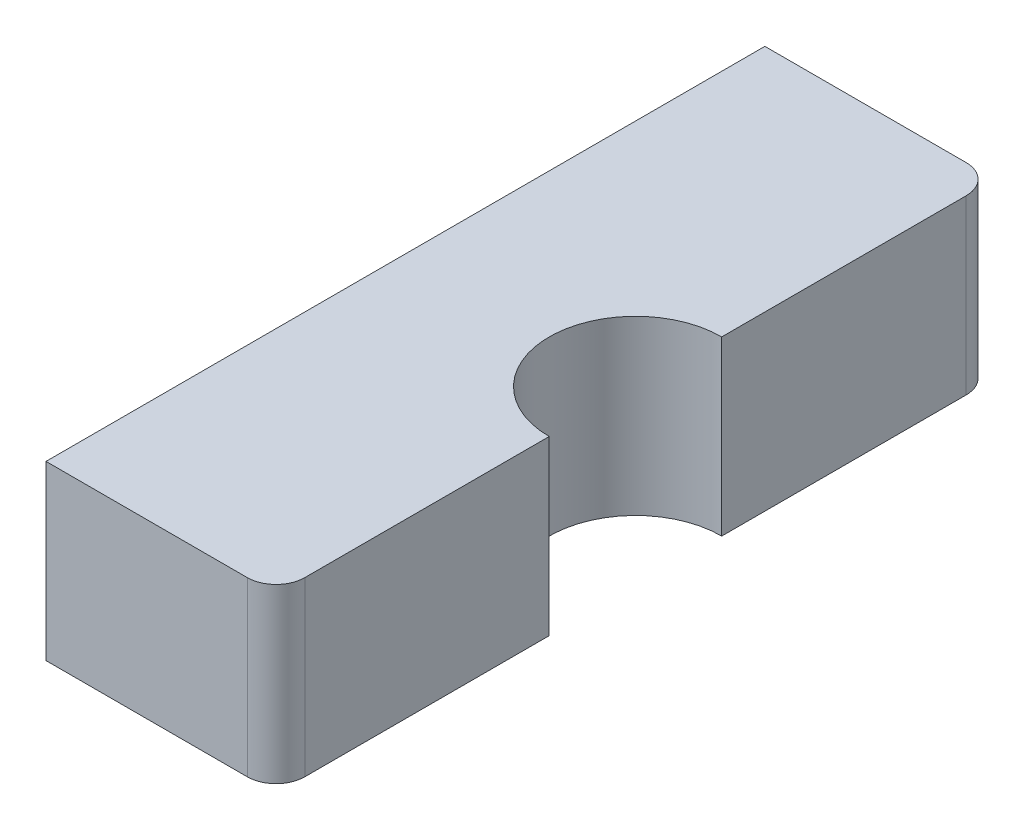
ISO-10303-21;
HEADER;
FILE_DESCRIPTION(('STEP AP214'),'2;1');
FILE_NAME('part.step','',(''),(''),'','','');
FILE_SCHEMA(('AUTOMOTIVE_DESIGN { 1 0 10303 214 1 1 1 1 }'));
ENDSEC;
DATA;
#1=APPLICATION_CONTEXT('core data for automotive mechanical design processes');
#2=APPLICATION_PROTOCOL_DEFINITION('international standard','automotive_design',2000,#1);
#3=PRODUCT_CONTEXT('',#1,'mechanical');
#4=PRODUCT('Part','Part','',(#3));
#5=PRODUCT_RELATED_PRODUCT_CATEGORY('part','',(#4));
#6=PRODUCT_DEFINITION_FORMATION('','',#4);
#7=PRODUCT_DEFINITION_CONTEXT('part definition',#1,'design');
#8=PRODUCT_DEFINITION('design','',#6,#7);
#9=PRODUCT_DEFINITION_SHAPE('','',#8);
#10=(LENGTH_UNIT() NAMED_UNIT(*) SI_UNIT(.MILLI.,.METRE.));
#11=(NAMED_UNIT(*) PLANE_ANGLE_UNIT() SI_UNIT($,.RADIAN.));
#12=(NAMED_UNIT(*) SI_UNIT($,.STERADIAN.) SOLID_ANGLE_UNIT());
#13=UNCERTAINTY_MEASURE_WITH_UNIT(LENGTH_MEASURE(1.E-05),#10,'distance_accuracy_value','');
#14=(GEOMETRIC_REPRESENTATION_CONTEXT(3) GLOBAL_UNCERTAINTY_ASSIGNED_CONTEXT((#13)) GLOBAL_UNIT_ASSIGNED_CONTEXT((#10,
#11,#12)) REPRESENTATION_CONTEXT('',''));
#15=CARTESIAN_POINT('',(0.,0.,0.));
#16=DIRECTION('',(0.,0.,1.));
#17=DIRECTION('',(1.,0.,0.));
#18=AXIS2_PLACEMENT_3D('',#15,#16,#17);
#19=CARTESIAN_POINT('',(0.95,0.3,0.575));
#20=DIRECTION('',(0.,-1.,0.));
#21=DIRECTION('',(0.,0.,-1.));
#22=AXIS2_PLACEMENT_3D('',#19,#20,#21);
#23=CYLINDRICAL_SURFACE('',#22,0.03);
#24=CARTESIAN_POINT('',(0.95,0.0200000000000002,0.575));
#25=DIRECTION('',(0.,1.,0.));
#26=DIRECTION('',(-1.,0.,0.));
#27=AXIS2_PLACEMENT_3D('',#24,#25,#26);
#28=CIRCLE('',#27,0.03);
#29=CARTESIAN_POINT('',(0.95,0.0200000000000002,0.605));
#30=VERTEX_POINT('',#29);
#31=CARTESIAN_POINT('',(0.98,0.0200000000000002,0.575000000000001));
#32=VERTEX_POINT('',#31);
#33=EDGE_CURVE('E11',#30,#32,#28,.T.);
#34=ORIENTED_EDGE('',*,*,#33,.F.);
#35=DIRECTION('',(0.,-1.,0.));
#36=VECTOR('',#35,1.);
#37=CARTESIAN_POINT('',(0.95,0.3,0.605));
#38=LINE('',#37,#36);
#39=CARTESIAN_POINT('',(0.95,0.28,0.605));
#40=VERTEX_POINT('',#39);
#41=EDGE_CURVE('E24',#40,#30,#38,.T.);
#42=ORIENTED_EDGE('',*,*,#41,.F.);
#43=CARTESIAN_POINT('',(0.95,0.28,0.575));
#44=DIRECTION('',(0.,-1.,0.));
#45=DIRECTION('',(1.,0.,0.));
#46=AXIS2_PLACEMENT_3D('',#43,#44,#45);
#47=CIRCLE('',#46,0.03);
#48=CARTESIAN_POINT('',(0.98,0.28,0.575000000000001));
#49=VERTEX_POINT('',#48);
#50=EDGE_CURVE('E256',#49,#40,#47,.T.);
#51=ORIENTED_EDGE('',*,*,#50,.F.);
#52=DIRECTION('',(0.,-1.,0.));
#53=VECTOR('',#52,1.);
#54=CARTESIAN_POINT('',(0.98,0.3,0.575000000000001));
#55=LINE('',#54,#53);
#56=EDGE_CURVE('E37',#49,#32,#55,.T.);
#57=ORIENTED_EDGE('',*,*,#56,.T.);
#58=EDGE_LOOP('',(#34,#42,#51,#57));
#59=FACE_BOUND('',#58,.T.);
#60=ADVANCED_FACE('F17',(#59),#23,.F.);
#61=CARTESIAN_POINT('',(0.98,0.3,0.168819430161342));
#62=DIRECTION('',(1.,0.,0.));
#63=DIRECTION('',(0.,0.,1.));
#64=AXIS2_PLACEMENT_3D('',#61,#62,#63);
#65=PLANE('',#64);
#66=DIRECTION('',(0.,0.,-1.));
#67=VECTOR('',#66,1.);
#68=CARTESIAN_POINT('',(0.98,0.0200000000000002,0.575000000000001));
#69=LINE('',#68,#67);
#70=CARTESIAN_POINT('',(0.98,0.0200000000000002,0.168819430161342));
#71=VERTEX_POINT('',#70);
#72=EDGE_CURVE('E253',#32,#71,#69,.T.);
#73=ORIENTED_EDGE('',*,*,#72,.F.);
#74=ORIENTED_EDGE('',*,*,#56,.F.);
#75=DIRECTION('',(0.,0.,1.));
#76=VECTOR('',#75,1.);
#77=CARTESIAN_POINT('',(0.98,0.28,0.168819430161342));
#78=LINE('',#77,#76);
#79=CARTESIAN_POINT('',(0.98,0.28,0.168819430161342));
#80=VERTEX_POINT('',#79);
#81=EDGE_CURVE('E250',#80,#49,#78,.T.);
#82=ORIENTED_EDGE('',*,*,#81,.F.);
#83=DIRECTION('',(0.,-1.,0.));
#84=VECTOR('',#83,1.);
#85=CARTESIAN_POINT('',(0.98,0.3,0.168819430161342));
#86=LINE('',#85,#84);
#87=EDGE_CURVE('E247',#80,#71,#86,.T.);
#88=ORIENTED_EDGE('',*,*,#87,.T.);
#89=EDGE_LOOP('',(#73,#74,#82,#88));
#90=FACE_BOUND('',#89,.T.);
#91=ADVANCED_FACE('F284',(#90),#65,.F.);
#92=CARTESIAN_POINT('',(1.,0.3,0.));
#93=DIRECTION('',(0.,-1.,0.));
#94=DIRECTION('',(0.,0.,-1.));
#95=AXIS2_PLACEMENT_3D('',#92,#93,#94);
#96=CYLINDRICAL_SURFACE('',#95,0.17);
#97=CARTESIAN_POINT('',(1.,0.0200000000000002,0.));
#98=DIRECTION('',(0.,-1.,0.));
#99=DIRECTION('',(-1.,0.,0.));
#100=AXIS2_PLACEMENT_3D('',#97,#98,#99);
#101=CIRCLE('',#100,0.17);
#102=CARTESIAN_POINT('',(0.98,0.0200000000000002,-0.168819430161341));
#103=VERTEX_POINT('',#102);
#104=EDGE_CURVE('E245',#71,#103,#101,.T.);
#105=ORIENTED_EDGE('',*,*,#104,.F.);
#106=ORIENTED_EDGE('',*,*,#87,.F.);
#107=CARTESIAN_POINT('',(1.,0.28,0.));
#108=DIRECTION('',(0.,1.,0.));
#109=DIRECTION('',(1.,0.,0.));
#110=AXIS2_PLACEMENT_3D('',#107,#108,#109);
#111=CIRCLE('',#110,0.17);
#112=CARTESIAN_POINT('',(0.98,0.28,-0.168819430161341));
#113=VERTEX_POINT('',#112);
#114=EDGE_CURVE('E242',#113,#80,#111,.T.);
#115=ORIENTED_EDGE('',*,*,#114,.F.);
#116=DIRECTION('',(0.,-1.,0.));
#117=VECTOR('',#116,1.);
#118=CARTESIAN_POINT('',(0.98,0.3,-0.168819430161341));
#119=LINE('',#118,#117);
#120=EDGE_CURVE('E239',#113,#103,#119,.T.);
#121=ORIENTED_EDGE('',*,*,#120,.T.);
#122=EDGE_LOOP('',(#105,#106,#115,#121));
#123=FACE_BOUND('',#122,.T.);
#124=ADVANCED_FACE('F280',(#123),#96,.T.);
#125=CARTESIAN_POINT('',(0.98,0.3,-0.575));
#126=DIRECTION('',(1.,0.,0.));
#127=DIRECTION('',(0.,0.,1.));
#128=AXIS2_PLACEMENT_3D('',#125,#126,#127);
#129=PLANE('',#128);
#130=DIRECTION('',(0.,0.,-1.));
#131=VECTOR('',#130,1.);
#132=CARTESIAN_POINT('',(0.98,0.0200000000000002,-0.168819430161341));
#133=LINE('',#132,#131);
#134=CARTESIAN_POINT('',(0.98,0.0200000000000002,-0.575));
#135=VERTEX_POINT('',#134);
#136=EDGE_CURVE('E237',#103,#135,#133,.T.);
#137=ORIENTED_EDGE('',*,*,#136,.F.);
#138=ORIENTED_EDGE('',*,*,#120,.F.);
#139=DIRECTION('',(0.,0.,1.));
#140=VECTOR('',#139,1.);
#141=CARTESIAN_POINT('',(0.98,0.28,-0.575));
#142=LINE('',#141,#140);
#143=CARTESIAN_POINT('',(0.98,0.28,-0.575));
#144=VERTEX_POINT('',#143);
#145=EDGE_CURVE('E234',#144,#113,#142,.T.);
#146=ORIENTED_EDGE('',*,*,#145,.F.);
#147=DIRECTION('',(0.,-1.,0.));
#148=VECTOR('',#147,1.);
#149=CARTESIAN_POINT('',(0.98,0.3,-0.575));
#150=LINE('',#149,#148);
#151=EDGE_CURVE('E231',#144,#135,#150,.T.);
#152=ORIENTED_EDGE('',*,*,#151,.T.);
#153=EDGE_LOOP('',(#137,#138,#146,#152));
#154=FACE_BOUND('',#153,.T.);
#155=ADVANCED_FACE('F276',(#154),#129,.F.);
#156=CARTESIAN_POINT('',(0.95,0.3,-0.575));
#157=DIRECTION('',(0.,-1.,0.));
#158=DIRECTION('',(0.,0.,-1.));
#159=AXIS2_PLACEMENT_3D('',#156,#157,#158);
#160=CYLINDRICAL_SURFACE('',#159,0.03);
#161=CARTESIAN_POINT('',(0.95,0.0200000000000002,-0.575));
#162=DIRECTION('',(0.,1.,0.));
#163=DIRECTION('',(-1.,0.,0.));
#164=AXIS2_PLACEMENT_3D('',#161,#162,#163);
#165=CIRCLE('',#164,0.03);
#166=CARTESIAN_POINT('',(0.95,0.0200000000000002,-0.605));
#167=VERTEX_POINT('',#166);
#168=EDGE_CURVE('E228',#135,#167,#165,.T.);
#169=ORIENTED_EDGE('',*,*,#168,.F.);
#170=ORIENTED_EDGE('',*,*,#151,.F.);
#171=CARTESIAN_POINT('',(0.95,0.28,-0.575));
#172=DIRECTION('',(0.,-1.,0.));
#173=DIRECTION('',(1.,0.,0.));
#174=AXIS2_PLACEMENT_3D('',#171,#172,#173);
#175=CIRCLE('',#174,0.03);
#176=CARTESIAN_POINT('',(0.95,0.28,-0.605));
#177=VERTEX_POINT('',#176);
#178=EDGE_CURVE('E225',#177,#144,#175,.T.);
#179=ORIENTED_EDGE('',*,*,#178,.F.);
#180=DIRECTION('',(0.,-1.,0.));
#181=VECTOR('',#180,1.);
#182=CARTESIAN_POINT('',(0.95,0.3,-0.605));
#183=LINE('',#182,#181);
#184=EDGE_CURVE('E223',#177,#167,#183,.T.);
#185=ORIENTED_EDGE('',*,*,#184,.T.);
#186=EDGE_LOOP('',(#169,#170,#179,#185));
#187=FACE_BOUND('',#186,.T.);
#188=ADVANCED_FACE('F273',(#187),#160,.F.);
#189=CARTESIAN_POINT('',(0.6,0.3,-0.605));
#190=DIRECTION('',(0.,0.,-1.));
#191=DIRECTION('',(1.,0.,0.));
#192=AXIS2_PLACEMENT_3D('',#189,#190,#191);
#193=PLANE('',#192);
#194=DIRECTION('',(-1.,0.,0.));
#195=VECTOR('',#194,1.);
#196=CARTESIAN_POINT('',(0.95,0.0200000000000002,-0.605));
#197=LINE('',#196,#195);
#198=CARTESIAN_POINT('',(0.6,0.0200000000000002,-0.605));
#199=VERTEX_POINT('',#198);
#200=EDGE_CURVE('E221',#167,#199,#197,.T.);
#201=ORIENTED_EDGE('',*,*,#200,.F.);
#202=ORIENTED_EDGE('',*,*,#184,.F.);
#203=DIRECTION('',(1.,0.,0.));
#204=VECTOR('',#203,1.);
#205=CARTESIAN_POINT('',(0.6,0.28,-0.605));
#206=LINE('',#205,#204);
#207=CARTESIAN_POINT('',(0.6,0.28,-0.605));
#208=VERTEX_POINT('',#207);
#209=EDGE_CURVE('E218',#208,#177,#206,.T.);
#210=ORIENTED_EDGE('',*,*,#209,.F.);
#211=DIRECTION('',(0.,-1.,0.));
#212=VECTOR('',#211,1.);
#213=CARTESIAN_POINT('',(0.6,0.3,-0.605));
#214=LINE('',#213,#212);
#215=EDGE_CURVE('E215',#208,#199,#214,.T.);
#216=ORIENTED_EDGE('',*,*,#215,.T.);
#217=EDGE_LOOP('',(#201,#202,#210,#216));
#218=FACE_BOUND('',#217,.T.);
#219=ADVANCED_FACE('F269',(#218),#193,.F.);
#220=CARTESIAN_POINT('',(0.95,0.3,0.605));
#221=DIRECTION('',(0.,0.,1.));
#222=DIRECTION('',(-1.,0.,0.));
#223=AXIS2_PLACEMENT_3D('',#220,#221,#222);
#224=PLANE('',#223);
#225=DIRECTION('',(1.,0.,0.));
#226=VECTOR('',#225,1.);
#227=CARTESIAN_POINT('',(0.6,0.0200000000000002,0.605));
#228=LINE('',#227,#226);
#229=CARTESIAN_POINT('',(0.6,0.0200000000000002,0.605));
#230=VERTEX_POINT('',#229);
#231=EDGE_CURVE('E212',#230,#30,#228,.T.);
#232=ORIENTED_EDGE('',*,*,#231,.F.);
#233=DIRECTION('',(0.,-1.,0.));
#234=VECTOR('',#233,1.);
#235=CARTESIAN_POINT('',(0.6,0.3,0.605));
#236=LINE('',#235,#234);
#237=CARTESIAN_POINT('',(0.6,0.28,0.605));
#238=VERTEX_POINT('',#237);
#239=EDGE_CURVE('E209',#238,#230,#236,.T.);
#240=ORIENTED_EDGE('',*,*,#239,.F.);
#241=DIRECTION('',(-1.,0.,0.));
#242=VECTOR('',#241,1.);
#243=CARTESIAN_POINT('',(0.95,0.28,0.605));
#244=LINE('',#243,#242);
#245=EDGE_CURVE('E206',#40,#238,#244,.T.);
#246=ORIENTED_EDGE('',*,*,#245,.F.);
#247=ORIENTED_EDGE('',*,*,#41,.T.);
#248=EDGE_LOOP('',(#232,#240,#246,#247));
#249=FACE_BOUND('',#248,.T.);
#250=ADVANCED_FACE('F260',(#249),#224,.F.);
#251=CARTESIAN_POINT('',(0.6,0.3,-0.625));
#252=DIRECTION('',(0.,0.,1.));
#253=DIRECTION('',(-1.,0.,0.));
#254=AXIS2_PLACEMENT_3D('',#251,#252,#253);
#255=PLANE('',#254);
#256=DIRECTION('',(1.,0.,0.));
#257=VECTOR('',#256,1.);
#258=CARTESIAN_POINT('',(0.6,0.,-0.625));
#259=LINE('',#258,#257);
#260=CARTESIAN_POINT('',(0.6,0.,-0.625));
#261=VERTEX_POINT('',#260);
#262=CARTESIAN_POINT('',(0.95,0.,-0.625));
#263=VERTEX_POINT('',#262);
#264=EDGE_CURVE('E204',#261,#263,#259,.T.);
#265=ORIENTED_EDGE('',*,*,#264,.F.);
#266=DIRECTION('',(0.,-1.,0.));
#267=VECTOR('',#266,1.);
#268=CARTESIAN_POINT('',(0.6,0.3,-0.625));
#269=LINE('',#268,#267);
#270=CARTESIAN_POINT('',(0.6,0.3,-0.625));
#271=VERTEX_POINT('',#270);
#272=EDGE_CURVE('E202',#271,#261,#269,.T.);
#273=ORIENTED_EDGE('',*,*,#272,.F.);
#274=DIRECTION('',(1.,0.,0.));
#275=VECTOR('',#274,1.);
#276=CARTESIAN_POINT('',(0.6,0.3,-0.625));
#277=LINE('',#276,#275);
#278=CARTESIAN_POINT('',(0.95,0.3,-0.625));
#279=VERTEX_POINT('',#278);
#280=EDGE_CURVE('E154',#271,#279,#277,.T.);
#281=ORIENTED_EDGE('',*,*,#280,.T.);
#282=DIRECTION('',(0.,-1.,0.));
#283=VECTOR('',#282,1.);
#284=CARTESIAN_POINT('',(0.95,0.3,-0.625));
#285=LINE('',#284,#283);
#286=EDGE_CURVE('E198',#279,#263,#285,.T.);
#287=ORIENTED_EDGE('',*,*,#286,.T.);
#288=EDGE_LOOP('',(#265,#273,#281,#287));
#289=FACE_BOUND('',#288,.T.);
#290=ADVANCED_FACE('F301',(#289),#255,.F.);
#291=CARTESIAN_POINT('',(0.95,0.3,-0.575));
#292=DIRECTION('',(0.,-1.,0.));
#293=DIRECTION('',(0.,0.,-1.));
#294=AXIS2_PLACEMENT_3D('',#291,#292,#293);
#295=CYLINDRICAL_SURFACE('',#294,0.05);
#296=CARTESIAN_POINT('',(0.95,0.,-0.575));
#297=DIRECTION('',(0.,-1.,0.));
#298=DIRECTION('',(0.,0.,1.));
#299=AXIS2_PLACEMENT_3D('',#296,#297,#298);
#300=CIRCLE('',#299,0.05);
#301=CARTESIAN_POINT('',(1.,0.,-0.575));
#302=VERTEX_POINT('',#301);
#303=EDGE_CURVE('E196',#263,#302,#300,.T.);
#304=ORIENTED_EDGE('',*,*,#303,.F.);
#305=ORIENTED_EDGE('',*,*,#286,.F.);
#306=CARTESIAN_POINT('',(0.95,0.3,-0.575));
#307=DIRECTION('',(0.,-1.,0.));
#308=DIRECTION('',(0.,0.,1.));
#309=AXIS2_PLACEMENT_3D('',#306,#307,#308);
#310=CIRCLE('',#309,0.05);
#311=CARTESIAN_POINT('',(1.,0.3,-0.575));
#312=VERTEX_POINT('',#311);
#313=EDGE_CURVE('E194',#279,#312,#310,.T.);
#314=ORIENTED_EDGE('',*,*,#313,.T.);
#315=DIRECTION('',(0.,-1.,0.));
#316=VECTOR('',#315,1.);
#317=CARTESIAN_POINT('',(1.,0.3,-0.575));
#318=LINE('',#317,#316);
#319=EDGE_CURVE('E191',#312,#302,#318,.T.);
#320=ORIENTED_EDGE('',*,*,#319,.T.);
#321=EDGE_LOOP('',(#304,#305,#314,#320));
#322=FACE_BOUND('',#321,.T.);
#323=ADVANCED_FACE('F304',(#322),#295,.T.);
#324=CARTESIAN_POINT('',(1.,0.3,-0.575));
#325=DIRECTION('',(-1.,0.,0.));
#326=DIRECTION('',(0.,0.,-1.));
#327=AXIS2_PLACEMENT_3D('',#324,#325,#326);
#328=PLANE('',#327);
#329=DIRECTION('',(0.,0.,1.));
#330=VECTOR('',#329,1.);
#331=CARTESIAN_POINT('',(1.,0.,-0.575));
#332=LINE('',#331,#330);
#333=CARTESIAN_POINT('',(1.,0.,-0.15));
#334=VERTEX_POINT('',#333);
#335=EDGE_CURVE('E189',#302,#334,#332,.T.);
#336=ORIENTED_EDGE('',*,*,#335,.F.);
#337=ORIENTED_EDGE('',*,*,#319,.F.);
#338=DIRECTION('',(0.,0.,1.));
#339=VECTOR('',#338,1.);
#340=CARTESIAN_POINT('',(1.,0.3,-0.575));
#341=LINE('',#340,#339);
#342=CARTESIAN_POINT('',(1.,0.3,-0.15));
#343=VERTEX_POINT('',#342);
#344=EDGE_CURVE('E187',#312,#343,#341,.T.);
#345=ORIENTED_EDGE('',*,*,#344,.T.);
#346=DIRECTION('',(0.,-1.,0.));
#347=VECTOR('',#346,1.);
#348=CARTESIAN_POINT('',(1.,0.3,-0.15));
#349=LINE('',#348,#347);
#350=EDGE_CURVE('E184',#343,#334,#349,.T.);
#351=ORIENTED_EDGE('',*,*,#350,.T.);
#352=EDGE_LOOP('',(#336,#337,#345,#351));
#353=FACE_BOUND('',#352,.T.);
#354=ADVANCED_FACE('F308',(#353),#328,.F.);
#355=CARTESIAN_POINT('',(1.,0.3,0.));
#356=DIRECTION('',(0.,-1.,0.));
#357=DIRECTION('',(0.,0.,-1.));
#358=AXIS2_PLACEMENT_3D('',#355,#356,#357);
#359=CYLINDRICAL_SURFACE('',#358,0.15);
#360=CARTESIAN_POINT('',(1.,0.,0.));
#361=DIRECTION('',(0.,1.,0.));
#362=DIRECTION('',(0.,0.,1.));
#363=AXIS2_PLACEMENT_3D('',#360,#361,#362);
#364=CIRCLE('',#363,0.15);
#365=CARTESIAN_POINT('',(1.,0.,0.15));
#366=VERTEX_POINT('',#365);
#367=EDGE_CURVE('E181',#334,#366,#364,.T.);
#368=ORIENTED_EDGE('',*,*,#367,.F.);
#369=ORIENTED_EDGE('',*,*,#350,.F.);
#370=CARTESIAN_POINT('',(1.,0.3,0.));
#371=DIRECTION('',(0.,1.,0.));
#372=DIRECTION('',(0.,0.,1.));
#373=AXIS2_PLACEMENT_3D('',#370,#371,#372);
#374=CIRCLE('',#373,0.15);
#375=CARTESIAN_POINT('',(1.,0.3,0.15));
#376=VERTEX_POINT('',#375);
#377=EDGE_CURVE('E178',#343,#376,#374,.T.);
#378=ORIENTED_EDGE('',*,*,#377,.T.);
#379=DIRECTION('',(0.,-1.,0.));
#380=VECTOR('',#379,1.);
#381=CARTESIAN_POINT('',(1.,0.3,0.15));
#382=LINE('',#381,#380);
#383=EDGE_CURVE('E176',#376,#366,#382,.T.);
#384=ORIENTED_EDGE('',*,*,#383,.T.);
#385=EDGE_LOOP('',(#368,#369,#378,#384));
#386=FACE_BOUND('',#385,.T.);
#387=ADVANCED_FACE('F312',(#386),#359,.F.);
#388=CARTESIAN_POINT('',(1.,0.3,0.15));
#389=DIRECTION('',(-1.,0.,0.));
#390=DIRECTION('',(0.,0.,-1.));
#391=AXIS2_PLACEMENT_3D('',#388,#389,#390);
#392=PLANE('',#391);
#393=DIRECTION('',(0.,0.,1.));
#394=VECTOR('',#393,1.);
#395=CARTESIAN_POINT('',(1.,0.,0.15));
#396=LINE('',#395,#394);
#397=CARTESIAN_POINT('',(1.,0.,0.575000000000001));
#398=VERTEX_POINT('',#397);
#399=EDGE_CURVE('E174',#366,#398,#396,.T.);
#400=ORIENTED_EDGE('',*,*,#399,.F.);
#401=ORIENTED_EDGE('',*,*,#383,.F.);
#402=DIRECTION('',(0.,0.,1.));
#403=VECTOR('',#402,1.);
#404=CARTESIAN_POINT('',(1.,0.3,0.15));
#405=LINE('',#404,#403);
#406=CARTESIAN_POINT('',(1.,0.3,0.575000000000001));
#407=VERTEX_POINT('',#406);
#408=EDGE_CURVE('E172',#376,#407,#405,.T.);
#409=ORIENTED_EDGE('',*,*,#408,.T.);
#410=DIRECTION('',(0.,-1.,0.));
#411=VECTOR('',#410,1.);
#412=CARTESIAN_POINT('',(1.,0.3,0.575000000000001));
#413=LINE('',#412,#411);
#414=EDGE_CURVE('E169',#407,#398,#413,.T.);
#415=ORIENTED_EDGE('',*,*,#414,.T.);
#416=EDGE_LOOP('',(#400,#401,#409,#415));
#417=FACE_BOUND('',#416,.T.);
#418=ADVANCED_FACE('F316',(#417),#392,.F.);
#419=CARTESIAN_POINT('',(0.95,0.3,0.575));
#420=DIRECTION('',(0.,-1.,0.));
#421=DIRECTION('',(0.,0.,-1.));
#422=AXIS2_PLACEMENT_3D('',#419,#420,#421);
#423=CYLINDRICAL_SURFACE('',#422,0.05);
#424=CARTESIAN_POINT('',(0.95,0.,0.575));
#425=DIRECTION('',(0.,-1.,0.));
#426=DIRECTION('',(0.,0.,1.));
#427=AXIS2_PLACEMENT_3D('',#424,#425,#426);
#428=CIRCLE('',#427,0.05);
#429=CARTESIAN_POINT('',(0.95,0.,0.625));
#430=VERTEX_POINT('',#429);
#431=EDGE_CURVE('E167',#398,#430,#428,.T.);
#432=ORIENTED_EDGE('',*,*,#431,.F.);
#433=ORIENTED_EDGE('',*,*,#414,.F.);
#434=CARTESIAN_POINT('',(0.95,0.3,0.575));
#435=DIRECTION('',(0.,-1.,0.));
#436=DIRECTION('',(0.,0.,1.));
#437=AXIS2_PLACEMENT_3D('',#434,#435,#436);
#438=CIRCLE('',#437,0.05);
#439=CARTESIAN_POINT('',(0.95,0.3,0.625));
#440=VERTEX_POINT('',#439);
#441=EDGE_CURVE('E165',#407,#440,#438,.T.);
#442=ORIENTED_EDGE('',*,*,#441,.T.);
#443=DIRECTION('',(0.,-1.,0.));
#444=VECTOR('',#443,1.);
#445=CARTESIAN_POINT('',(0.95,0.3,0.625));
#446=LINE('',#445,#444);
#447=EDGE_CURVE('E136',#440,#430,#446,.T.);
#448=ORIENTED_EDGE('',*,*,#447,.T.);
#449=EDGE_LOOP('',(#432,#433,#442,#448));
#450=FACE_BOUND('',#449,.T.);
#451=ADVANCED_FACE('F320',(#450),#423,.T.);
#452=CARTESIAN_POINT('',(0.95,0.3,0.625));
#453=DIRECTION('',(0.,0.,-1.));
#454=DIRECTION('',(1.,0.,0.));
#455=AXIS2_PLACEMENT_3D('',#452,#453,#454);
#456=PLANE('',#455);
#457=DIRECTION('',(-1.,0.,0.));
#458=VECTOR('',#457,1.);
#459=CARTESIAN_POINT('',(0.95,0.,0.625));
#460=LINE('',#459,#458);
#461=CARTESIAN_POINT('',(0.6,0.,0.625));
#462=VERTEX_POINT('',#461);
#463=EDGE_CURVE('E140',#430,#462,#460,.T.);
#464=ORIENTED_EDGE('',*,*,#463,.F.);
#465=ORIENTED_EDGE('',*,*,#447,.F.);
#466=DIRECTION('',(-1.,0.,0.));
#467=VECTOR('',#466,1.);
#468=CARTESIAN_POINT('',(0.95,0.3,0.625));
#469=LINE('',#468,#467);
#470=CARTESIAN_POINT('',(0.6,0.3,0.625));
#471=VERTEX_POINT('',#470);
#472=EDGE_CURVE('E129',#440,#471,#469,.T.);
#473=ORIENTED_EDGE('',*,*,#472,.T.);
#474=DIRECTION('',(0.,-1.,0.));
#475=VECTOR('',#474,1.);
#476=CARTESIAN_POINT('',(0.6,0.3,0.625));
#477=LINE('',#476,#475);
#478=EDGE_CURVE('E133',#471,#462,#477,.T.);
#479=ORIENTED_EDGE('',*,*,#478,.T.);
#480=EDGE_LOOP('',(#464,#465,#473,#479));
#481=FACE_BOUND('',#480,.T.);
#482=ADVANCED_FACE('F132',(#481),#456,.F.);
#483=CARTESIAN_POINT('',(0.6,0.3,0.605));
#484=DIRECTION('',(1.,0.,0.));
#485=DIRECTION('',(0.,0.,1.));
#486=AXIS2_PLACEMENT_3D('',#483,#484,#485);
#487=PLANE('',#486);
#488=DIRECTION('',(0.,0.,1.));
#489=VECTOR('',#488,1.);
#490=CARTESIAN_POINT('',(0.6,0.0200000000000002,-0.605));
#491=LINE('',#490,#489);
#492=EDGE_CURVE('E149',#199,#230,#491,.T.);
#493=ORIENTED_EDGE('',*,*,#492,.F.);
#494=ORIENTED_EDGE('',*,*,#215,.F.);
#495=DIRECTION('',(0.,0.,-1.));
#496=VECTOR('',#495,1.);
#497=CARTESIAN_POINT('',(0.6,0.28,0.605));
#498=LINE('',#497,#496);
#499=EDGE_CURVE('E156',#238,#208,#498,.T.);
#500=ORIENTED_EDGE('',*,*,#499,.F.);
#501=ORIENTED_EDGE('',*,*,#239,.T.);
#502=EDGE_LOOP('',(#493,#494,#500,#501));
#503=FACE_BOUND('',#502,.T.);
#504=DIRECTION('',(0.,0.,-1.));
#505=VECTOR('',#504,1.);
#506=CARTESIAN_POINT('',(0.6,0.,0.605));
#507=LINE('',#506,#505);
#508=EDGE_CURVE('E148',#462,#261,#507,.T.);
#509=ORIENTED_EDGE('',*,*,#508,.F.);
#510=ORIENTED_EDGE('',*,*,#478,.F.);
#511=DIRECTION('',(0.,0.,-1.));
#512=VECTOR('',#511,1.);
#513=CARTESIAN_POINT('',(0.6,0.3,-0.625));
#514=LINE('',#513,#512);
#515=EDGE_CURVE('E146',#471,#271,#514,.T.);
#516=ORIENTED_EDGE('',*,*,#515,.T.);
#517=ORIENTED_EDGE('',*,*,#272,.T.);
#518=EDGE_LOOP('',(#509,#510,#516,#517));
#519=FACE_BOUND('',#518,.T.);
#520=ADVANCED_FACE('F144',(#503,#519),#487,.F.);
#521=CARTESIAN_POINT('',(0.95,0.3,0.575));
#522=DIRECTION('',(0.,1.,0.));
#523=DIRECTION('',(0.,0.,1.));
#524=AXIS2_PLACEMENT_3D('',#521,#522,#523);
#525=PLANE('',#524);
#526=ORIENTED_EDGE('',*,*,#472,.F.);
#527=ORIENTED_EDGE('',*,*,#441,.F.);
#528=ORIENTED_EDGE('',*,*,#408,.F.);
#529=ORIENTED_EDGE('',*,*,#377,.F.);
#530=ORIENTED_EDGE('',*,*,#344,.F.);
#531=ORIENTED_EDGE('',*,*,#313,.F.);
#532=ORIENTED_EDGE('',*,*,#280,.F.);
#533=ORIENTED_EDGE('',*,*,#515,.F.);
#534=EDGE_LOOP('',(#526,#527,#528,#529,#530,#531,#532,#533));
#535=FACE_BOUND('',#534,.T.);
#536=ADVANCED_FACE('F152',(#535),#525,.T.);
#537=CARTESIAN_POINT('',(0.95,0.,0.575));
#538=DIRECTION('',(0.,1.,0.));
#539=DIRECTION('',(0.,0.,1.));
#540=AXIS2_PLACEMENT_3D('',#537,#538,#539);
#541=PLANE('',#540);
#542=ORIENTED_EDGE('',*,*,#264,.T.);
#543=ORIENTED_EDGE('',*,*,#303,.T.);
#544=ORIENTED_EDGE('',*,*,#335,.T.);
#545=ORIENTED_EDGE('',*,*,#367,.T.);
#546=ORIENTED_EDGE('',*,*,#399,.T.);
#547=ORIENTED_EDGE('',*,*,#431,.T.);
#548=ORIENTED_EDGE('',*,*,#463,.T.);
#549=ORIENTED_EDGE('',*,*,#508,.T.);
#550=EDGE_LOOP('',(#542,#543,#544,#545,#546,#547,#548,#549));
#551=FACE_BOUND('',#550,.T.);
#552=ADVANCED_FACE('F331',(#551),#541,.F.);
#553=CARTESIAN_POINT('',(0.95,0.28,0.575));
#554=DIRECTION('',(0.,1.,0.));
#555=DIRECTION('',(1.,0.,0.));
#556=AXIS2_PLACEMENT_3D('',#553,#554,#555);
#557=PLANE('',#556);
#558=ORIENTED_EDGE('',*,*,#50,.T.);
#559=ORIENTED_EDGE('',*,*,#245,.T.);
#560=ORIENTED_EDGE('',*,*,#499,.T.);
#561=ORIENTED_EDGE('',*,*,#209,.T.);
#562=ORIENTED_EDGE('',*,*,#178,.T.);
#563=ORIENTED_EDGE('',*,*,#145,.T.);
#564=ORIENTED_EDGE('',*,*,#114,.T.);
#565=ORIENTED_EDGE('',*,*,#81,.T.);
#566=EDGE_LOOP('',(#558,#559,#560,#561,#562,#563,#564,#565));
#567=FACE_BOUND('',#566,.T.);
#568=ADVANCED_FACE('F258',(#567),#557,.F.);
#569=CARTESIAN_POINT('',(0.95,0.0200000000000002,0.575));
#570=DIRECTION('',(0.,-1.,0.));
#571=DIRECTION('',(-1.,0.,0.));
#572=AXIS2_PLACEMENT_3D('',#569,#570,#571);
#573=PLANE('',#572);
#574=ORIENTED_EDGE('',*,*,#492,.T.);
#575=ORIENTED_EDGE('',*,*,#231,.T.);
#576=ORIENTED_EDGE('',*,*,#33,.T.);
#577=ORIENTED_EDGE('',*,*,#72,.T.);
#578=ORIENTED_EDGE('',*,*,#104,.T.);
#579=ORIENTED_EDGE('',*,*,#136,.T.);
#580=ORIENTED_EDGE('',*,*,#168,.T.);
#581=ORIENTED_EDGE('',*,*,#200,.T.);
#582=EDGE_LOOP('',(#574,#575,#576,#577,#578,#579,#580,#581));
#583=FACE_BOUND('',#582,.T.);
#584=ADVANCED_FACE('F265',(#583),#573,.F.);
#585=CLOSED_SHELL('',(#60,#91,#124,#155,#188,#219,#250,#290,#323,#354,#387,#418,#451,#482,#520,
#536,#552,#568,#584));
#586=MANIFOLD_SOLID_BREP('B1',#585);
#587=ADVANCED_BREP_SHAPE_REPRESENTATION('',(#18,#586),#14);
#588=SHAPE_DEFINITION_REPRESENTATION(#9,#587);
ENDSEC;
END-ISO-10303-21;
